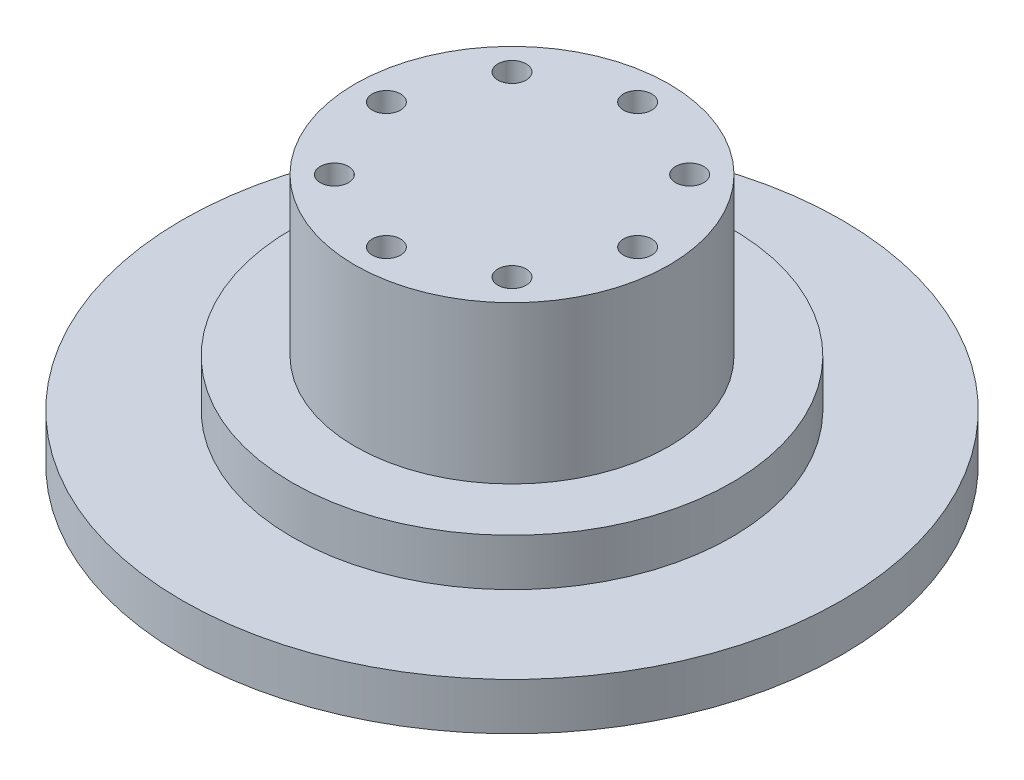
ISO-10303-21;
HEADER;
FILE_DESCRIPTION(('STEP AP214'),'2;1');
FILE_NAME('part.step','',(''),(''),'','','');
FILE_SCHEMA(('AUTOMOTIVE_DESIGN { 1 0 10303 214 1 1 1 1 }'));
ENDSEC;
DATA;
#1=APPLICATION_CONTEXT('core data for automotive mechanical design processes');
#2=APPLICATION_PROTOCOL_DEFINITION('international standard','automotive_design',2000,#1);
#3=PRODUCT_CONTEXT('',#1,'mechanical');
#4=PRODUCT('Part','Part','',(#3));
#5=PRODUCT_RELATED_PRODUCT_CATEGORY('part','',(#4));
#6=PRODUCT_DEFINITION_FORMATION('','',#4);
#7=PRODUCT_DEFINITION_CONTEXT('part definition',#1,'design');
#8=PRODUCT_DEFINITION('design','',#6,#7);
#9=PRODUCT_DEFINITION_SHAPE('','',#8);
#10=(LENGTH_UNIT() NAMED_UNIT(*) SI_UNIT(.MILLI.,.METRE.));
#11=(NAMED_UNIT(*) PLANE_ANGLE_UNIT() SI_UNIT($,.RADIAN.));
#12=(NAMED_UNIT(*) SI_UNIT($,.STERADIAN.) SOLID_ANGLE_UNIT());
#13=UNCERTAINTY_MEASURE_WITH_UNIT(LENGTH_MEASURE(1.E-05),#10,'distance_accuracy_value','');
#14=(GEOMETRIC_REPRESENTATION_CONTEXT(3) GLOBAL_UNCERTAINTY_ASSIGNED_CONTEXT((#13)) GLOBAL_UNIT_ASSIGNED_CONTEXT((#10,
#11,#12)) REPRESENTATION_CONTEXT('',''));
#15=CARTESIAN_POINT('',(0.,0.,0.));
#16=DIRECTION('',(0.,0.,1.));
#17=DIRECTION('',(1.,0.,0.));
#18=AXIS2_PLACEMENT_3D('',#15,#16,#17);
#19=CARTESIAN_POINT('',(0.,3.,0.));
#20=DIRECTION('',(0.,-1.,0.));
#21=DIRECTION('',(0.,0.,-1.));
#22=AXIS2_PLACEMENT_3D('',#19,#20,#21);
#23=CYLINDRICAL_SURFACE('',#22,21.);
#24=CARTESIAN_POINT('',(0.,3.,0.));
#25=DIRECTION('',(0.,1.,0.));
#26=DIRECTION('',(0.,0.,1.));
#27=AXIS2_PLACEMENT_3D('',#24,#25,#26);
#28=CIRCLE('',#27,21.);
#29=CARTESIAN_POINT('',(0.,3.,21.));
#30=VERTEX_POINT('',#29);
#31=EDGE_CURVE('E10',#30,#30,#28,.T.);
#32=ORIENTED_EDGE('',*,*,#31,.F.);
#33=EDGE_LOOP('',(#32));
#34=FACE_BOUND('',#33,.T.);
#35=CARTESIAN_POINT('',(0.,0.,0.));
#36=DIRECTION('',(0.,1.,0.));
#37=DIRECTION('',(0.,0.,1.));
#38=AXIS2_PLACEMENT_3D('',#35,#36,#37);
#39=CIRCLE('',#38,21.);
#40=CARTESIAN_POINT('',(0.,0.,21.));
#41=VERTEX_POINT('',#40);
#42=EDGE_CURVE('E38',#41,#41,#39,.T.);
#43=ORIENTED_EDGE('',*,*,#42,.T.);
#44=EDGE_LOOP('',(#43));
#45=FACE_BOUND('',#44,.T.);
#46=ADVANCED_FACE('F31',(#34,#45),#23,.T.);
#47=CARTESIAN_POINT('',(0.,3.,0.));
#48=DIRECTION('',(0.,1.,0.));
#49=DIRECTION('',(0.,0.,1.));
#50=AXIS2_PLACEMENT_3D('',#47,#48,#49);
#51=PLANE('',#50);
#52=CARTESIAN_POINT('',(0.,3.,0.));
#53=DIRECTION('',(0.,1.,0.));
#54=DIRECTION('',(0.,0.,1.));
#55=AXIS2_PLACEMENT_3D('',#52,#53,#54);
#56=CIRCLE('',#55,14.);
#57=CARTESIAN_POINT('',(0.,3.,14.));
#58=VERTEX_POINT('',#57);
#59=EDGE_CURVE('E47',#58,#58,#56,.T.);
#60=ORIENTED_EDGE('',*,*,#59,.F.);
#61=EDGE_LOOP('',(#60));
#62=FACE_BOUND('',#61,.T.);
#63=ORIENTED_EDGE('',*,*,#31,.T.);
#64=EDGE_LOOP('',(#63));
#65=FACE_BOUND('',#64,.T.);
#66=ADVANCED_FACE('F109',(#62,#65),#51,.T.);
#67=CARTESIAN_POINT('',(0.,0.,0.));
#68=DIRECTION('',(0.,1.,0.));
#69=DIRECTION('',(0.,0.,1.));
#70=AXIS2_PLACEMENT_3D('',#67,#68,#69);
#71=PLANE('',#70);
#72=CARTESIAN_POINT('',(-5.65685424949238,0.,5.65685424949238));
#73=DIRECTION('',(0.,-1.,0.));
#74=DIRECTION('',(0.,0.,1.));
#75=AXIS2_PLACEMENT_3D('',#72,#73,#74);
#76=CIRCLE('',#75,0.900000000000002);
#77=CARTESIAN_POINT('',(-5.65685424949238,0.,6.55685424949238));
#78=VERTEX_POINT('',#77);
#79=EDGE_CURVE('E81',#78,#78,#76,.T.);
#80=ORIENTED_EDGE('',*,*,#79,.F.);
#81=EDGE_LOOP('',(#80));
#82=FACE_BOUND('',#81,.T.);
#83=CARTESIAN_POINT('',(0.,0.,-8.));
#84=DIRECTION('',(0.,-1.,0.));
#85=DIRECTION('',(0.,0.,1.));
#86=AXIS2_PLACEMENT_3D('',#83,#84,#85);
#87=CIRCLE('',#86,0.900000000000001);
#88=CARTESIAN_POINT('',(0.,0.,-7.1));
#89=VERTEX_POINT('',#88);
#90=EDGE_CURVE('E82',#89,#89,#87,.T.);
#91=ORIENTED_EDGE('',*,*,#90,.F.);
#92=EDGE_LOOP('',(#91));
#93=FACE_BOUND('',#92,.T.);
#94=CARTESIAN_POINT('',(-5.65685424949238,0.,-5.65685424949238));
#95=DIRECTION('',(0.,-1.,0.));
#96=DIRECTION('',(0.,0.,1.));
#97=AXIS2_PLACEMENT_3D('',#94,#95,#96);
#98=CIRCLE('',#97,0.9);
#99=CARTESIAN_POINT('',(-5.65685424949238,0.,-4.75685424949238));
#100=VERTEX_POINT('',#99);
#101=EDGE_CURVE('E93',#100,#100,#98,.T.);
#102=ORIENTED_EDGE('',*,*,#101,.F.);
#103=EDGE_LOOP('',(#102));
#104=FACE_BOUND('',#103,.T.);
#105=CARTESIAN_POINT('',(-8.,0.,0.));
#106=DIRECTION('',(0.,-1.,0.));
#107=DIRECTION('',(0.,0.,-1.));
#108=AXIS2_PLACEMENT_3D('',#105,#106,#107);
#109=CIRCLE('',#108,0.899999999999998);
#110=CARTESIAN_POINT('',(-8.,0.,-0.899999999999998));
#111=VERTEX_POINT('',#110);
#112=EDGE_CURVE('E94',#111,#111,#109,.T.);
#113=ORIENTED_EDGE('',*,*,#112,.F.);
#114=EDGE_LOOP('',(#113));
#115=FACE_BOUND('',#114,.T.);
#116=CARTESIAN_POINT('',(0.,0.,8.));
#117=DIRECTION('',(0.,-1.,0.));
#118=DIRECTION('',(0.,0.,1.));
#119=AXIS2_PLACEMENT_3D('',#116,#117,#118);
#120=CIRCLE('',#119,0.9);
#121=CARTESIAN_POINT('',(0.,0.,8.9));
#122=VERTEX_POINT('',#121);
#123=EDGE_CURVE('E64',#122,#122,#120,.T.);
#124=ORIENTED_EDGE('',*,*,#123,.F.);
#125=EDGE_LOOP('',(#124));
#126=FACE_BOUND('',#125,.T.);
#127=CARTESIAN_POINT('',(5.65685424949238,0.,5.65685424949238));
#128=DIRECTION('',(0.,-1.,0.));
#129=DIRECTION('',(0.,0.,-1.));
#130=AXIS2_PLACEMENT_3D('',#127,#128,#129);
#131=CIRCLE('',#130,0.899999999999999);
#132=CARTESIAN_POINT('',(5.65685424949238,0.,4.75685424949238));
#133=VERTEX_POINT('',#132);
#134=EDGE_CURVE('E63',#133,#133,#131,.T.);
#135=ORIENTED_EDGE('',*,*,#134,.F.);
#136=EDGE_LOOP('',(#135));
#137=FACE_BOUND('',#136,.T.);
#138=CARTESIAN_POINT('',(5.65685424949238,0.,-5.65685424949238));
#139=DIRECTION('',(0.,-1.,0.));
#140=DIRECTION('',(0.,0.,-1.));
#141=AXIS2_PLACEMENT_3D('',#138,#139,#140);
#142=CIRCLE('',#141,0.899999999999999);
#143=CARTESIAN_POINT('',(5.65685424949238,0.,-6.55685424949238));
#144=VERTEX_POINT('',#143);
#145=EDGE_CURVE('E71',#144,#144,#142,.T.);
#146=ORIENTED_EDGE('',*,*,#145,.F.);
#147=EDGE_LOOP('',(#146));
#148=FACE_BOUND('',#147,.T.);
#149=CARTESIAN_POINT('',(8.,0.,0.));
#150=DIRECTION('',(0.,-1.,0.));
#151=DIRECTION('',(0.,0.,-1.));
#152=AXIS2_PLACEMENT_3D('',#149,#150,#151);
#153=CIRCLE('',#152,0.9);
#154=CARTESIAN_POINT('',(8.,0.,-0.9));
#155=VERTEX_POINT('',#154);
#156=EDGE_CURVE('E56',#155,#155,#153,.T.);
#157=ORIENTED_EDGE('',*,*,#156,.F.);
#158=EDGE_LOOP('',(#157));
#159=FACE_BOUND('',#158,.T.);
#160=ORIENTED_EDGE('',*,*,#42,.F.);
#161=EDGE_LOOP('',(#160));
#162=FACE_BOUND('',#161,.T.);
#163=ADVANCED_FACE('F105',(#82,#93,#104,#115,#126,#137,#148,#159,#162),#71,.F.);
#164=CARTESIAN_POINT('',(0.,6.,0.));
#165=DIRECTION('',(0.,-1.,0.));
#166=DIRECTION('',(0.,0.,-1.));
#167=AXIS2_PLACEMENT_3D('',#164,#165,#166);
#168=CYLINDRICAL_SURFACE('',#167,14.);
#169=CARTESIAN_POINT('',(0.,6.,0.));
#170=DIRECTION('',(0.,1.,0.));
#171=DIRECTION('',(0.,0.,1.));
#172=AXIS2_PLACEMENT_3D('',#169,#170,#171);
#173=CIRCLE('',#172,14.);
#174=CARTESIAN_POINT('',(0.,6.,14.));
#175=VERTEX_POINT('',#174);
#176=EDGE_CURVE('E50',#175,#175,#173,.T.);
#177=ORIENTED_EDGE('',*,*,#176,.F.);
#178=EDGE_LOOP('',(#177));
#179=FACE_BOUND('',#178,.T.);
#180=ORIENTED_EDGE('',*,*,#59,.T.);
#181=EDGE_LOOP('',(#180));
#182=FACE_BOUND('',#181,.T.);
#183=ADVANCED_FACE('F108',(#179,#182),#168,.T.);
#184=CARTESIAN_POINT('',(0.,6.,0.));
#185=DIRECTION('',(0.,1.,0.));
#186=DIRECTION('',(0.,0.,1.));
#187=AXIS2_PLACEMENT_3D('',#184,#185,#186);
#188=PLANE('',#187);
#189=CARTESIAN_POINT('',(0.,6.,0.));
#190=DIRECTION('',(0.,1.,0.));
#191=DIRECTION('',(0.,0.,1.));
#192=AXIS2_PLACEMENT_3D('',#189,#190,#191);
#193=CIRCLE('',#192,10.);
#194=CARTESIAN_POINT('',(0.,6.,10.));
#195=VERTEX_POINT('',#194);
#196=EDGE_CURVE('E34',#195,#195,#193,.T.);
#197=ORIENTED_EDGE('',*,*,#196,.F.);
#198=EDGE_LOOP('',(#197));
#199=FACE_BOUND('',#198,.T.);
#200=ORIENTED_EDGE('',*,*,#176,.T.);
#201=EDGE_LOOP('',(#200));
#202=FACE_BOUND('',#201,.T.);
#203=ADVANCED_FACE('F142',(#199,#202),#188,.T.);
#204=CARTESIAN_POINT('',(0.,16.,0.));
#205=DIRECTION('',(0.,1.,0.));
#206=DIRECTION('',(0.,0.,1.));
#207=AXIS2_PLACEMENT_3D('',#204,#205,#206);
#208=PLANE('',#207);
#209=CARTESIAN_POINT('',(-5.65685424949238,16.,5.65685424949238));
#210=DIRECTION('',(0.,1.,0.));
#211=DIRECTION('',(0.,0.,1.));
#212=AXIS2_PLACEMENT_3D('',#209,#210,#211);
#213=CIRCLE('',#212,0.900000000000002);
#214=CARTESIAN_POINT('',(-5.65685424949238,16.,6.55685424949238));
#215=VERTEX_POINT('',#214);
#216=EDGE_CURVE('E67',#215,#215,#213,.F.);
#217=ORIENTED_EDGE('',*,*,#216,.T.);
#218=EDGE_LOOP('',(#217));
#219=FACE_BOUND('',#218,.T.);
#220=CARTESIAN_POINT('',(0.,16.,-8.));
#221=DIRECTION('',(0.,1.,0.));
#222=DIRECTION('',(0.,0.,1.));
#223=AXIS2_PLACEMENT_3D('',#220,#221,#222);
#224=CIRCLE('',#223,0.900000000000001);
#225=CARTESIAN_POINT('',(0.,16.,-7.1));
#226=VERTEX_POINT('',#225);
#227=EDGE_CURVE('E78',#226,#226,#224,.F.);
#228=ORIENTED_EDGE('',*,*,#227,.T.);
#229=EDGE_LOOP('',(#228));
#230=FACE_BOUND('',#229,.T.);
#231=CARTESIAN_POINT('',(-5.65685424949238,16.,-5.65685424949238));
#232=DIRECTION('',(0.,1.,0.));
#233=DIRECTION('',(0.,0.,1.));
#234=AXIS2_PLACEMENT_3D('',#231,#232,#233);
#235=CIRCLE('',#234,0.9);
#236=CARTESIAN_POINT('',(-5.65685424949238,16.,-4.75685424949238));
#237=VERTEX_POINT('',#236);
#238=EDGE_CURVE('E85',#237,#237,#235,.F.);
#239=ORIENTED_EDGE('',*,*,#238,.T.);
#240=EDGE_LOOP('',(#239));
#241=FACE_BOUND('',#240,.T.);
#242=CARTESIAN_POINT('',(-8.,16.,0.));
#243=DIRECTION('',(0.,1.,0.));
#244=DIRECTION('',(0.,0.,1.));
#245=AXIS2_PLACEMENT_3D('',#242,#243,#244);
#246=CIRCLE('',#245,0.899999999999998);
#247=CARTESIAN_POINT('',(-8.,16.,0.899999999999998));
#248=VERTEX_POINT('',#247);
#249=EDGE_CURVE('E90',#248,#248,#246,.F.);
#250=ORIENTED_EDGE('',*,*,#249,.T.);
#251=EDGE_LOOP('',(#250));
#252=FACE_BOUND('',#251,.T.);
#253=CARTESIAN_POINT('',(0.,16.,8.));
#254=DIRECTION('',(0.,1.,0.));
#255=DIRECTION('',(0.,0.,1.));
#256=AXIS2_PLACEMENT_3D('',#253,#254,#255);
#257=CIRCLE('',#256,0.9);
#258=CARTESIAN_POINT('',(0.,16.,8.9));
#259=VERTEX_POINT('',#258);
#260=EDGE_CURVE('E60',#259,#259,#257,.F.);
#261=ORIENTED_EDGE('',*,*,#260,.T.);
#262=EDGE_LOOP('',(#261));
#263=FACE_BOUND('',#262,.T.);
#264=CARTESIAN_POINT('',(5.65685424949238,16.,5.65685424949238));
#265=DIRECTION('',(0.,1.,0.));
#266=DIRECTION('',(0.,0.,1.));
#267=AXIS2_PLACEMENT_3D('',#264,#265,#266);
#268=CIRCLE('',#267,0.899999999999999);
#269=CARTESIAN_POINT('',(5.65685424949238,16.,6.55685424949238));
#270=VERTEX_POINT('',#269);
#271=EDGE_CURVE('E68',#270,#270,#268,.F.);
#272=ORIENTED_EDGE('',*,*,#271,.T.);
#273=EDGE_LOOP('',(#272));
#274=FACE_BOUND('',#273,.T.);
#275=CARTESIAN_POINT('',(5.65685424949238,16.,-5.65685424949238));
#276=DIRECTION('',(0.,1.,0.));
#277=DIRECTION('',(0.,0.,1.));
#278=AXIS2_PLACEMENT_3D('',#275,#276,#277);
#279=CIRCLE('',#278,0.899999999999999);
#280=CARTESIAN_POINT('',(5.65685424949238,16.,-4.75685424949238));
#281=VERTEX_POINT('',#280);
#282=EDGE_CURVE('E59',#281,#281,#279,.F.);
#283=ORIENTED_EDGE('',*,*,#282,.T.);
#284=EDGE_LOOP('',(#283));
#285=FACE_BOUND('',#284,.T.);
#286=CARTESIAN_POINT('',(8.,16.,0.));
#287=DIRECTION('',(0.,1.,0.));
#288=DIRECTION('',(0.,0.,1.));
#289=AXIS2_PLACEMENT_3D('',#286,#287,#288);
#290=CIRCLE('',#289,0.9);
#291=CARTESIAN_POINT('',(8.,16.,0.9));
#292=VERTEX_POINT('',#291);
#293=EDGE_CURVE('E51',#292,#292,#290,.F.);
#294=ORIENTED_EDGE('',*,*,#293,.T.);
#295=EDGE_LOOP('',(#294));
#296=FACE_BOUND('',#295,.T.);
#297=CARTESIAN_POINT('',(0.,16.,0.));
#298=DIRECTION('',(0.,1.,0.));
#299=DIRECTION('',(0.,0.,1.));
#300=AXIS2_PLACEMENT_3D('',#297,#298,#299);
#301=CIRCLE('',#300,10.);
#302=CARTESIAN_POINT('',(0.,16.,10.));
#303=VERTEX_POINT('',#302);
#304=EDGE_CURVE('E43',#303,#303,#301,.T.);
#305=ORIENTED_EDGE('',*,*,#304,.T.);
#306=EDGE_LOOP('',(#305));
#307=FACE_BOUND('',#306,.T.);
#308=ADVANCED_FACE('F138',(#219,#230,#241,#252,#263,#274,#285,#296,#307),#208,.T.);
#309=CARTESIAN_POINT('',(0.,16.,0.));
#310=DIRECTION('',(0.,-1.,0.));
#311=DIRECTION('',(0.,0.,-1.));
#312=AXIS2_PLACEMENT_3D('',#309,#310,#311);
#313=CYLINDRICAL_SURFACE('',#312,10.);
#314=ORIENTED_EDGE('',*,*,#196,.T.);
#315=EDGE_LOOP('',(#314));
#316=FACE_BOUND('',#315,.T.);
#317=ORIENTED_EDGE('',*,*,#304,.F.);
#318=EDGE_LOOP('',(#317));
#319=FACE_BOUND('',#318,.T.);
#320=ADVANCED_FACE('F134',(#316,#319),#313,.T.);
#321=CARTESIAN_POINT('',(8.,18.5455844122716,0.));
#322=DIRECTION('',(0.,-1.,0.));
#323=DIRECTION('',(0.,0.,-1.));
#324=AXIS2_PLACEMENT_3D('',#321,#322,#323);
#325=CYLINDRICAL_SURFACE('',#324,0.9);
#326=ORIENTED_EDGE('',*,*,#156,.T.);
#327=EDGE_LOOP('',(#326));
#328=FACE_BOUND('',#327,.T.);
#329=ORIENTED_EDGE('',*,*,#293,.F.);
#330=EDGE_LOOP('',(#329));
#331=FACE_BOUND('',#330,.T.);
#332=ADVANCED_FACE('F137',(#328,#331),#325,.F.);
#333=CARTESIAN_POINT('',(5.65685424949238,18.5455844122716,-5.65685424949238));
#334=DIRECTION('',(0.,-1.,0.));
#335=DIRECTION('',(0.,0.,-1.));
#336=AXIS2_PLACEMENT_3D('',#333,#334,#335);
#337=CYLINDRICAL_SURFACE('',#336,0.899999999999999);
#338=ORIENTED_EDGE('',*,*,#145,.T.);
#339=EDGE_LOOP('',(#338));
#340=FACE_BOUND('',#339,.T.);
#341=ORIENTED_EDGE('',*,*,#282,.F.);
#342=EDGE_LOOP('',(#341));
#343=FACE_BOUND('',#342,.T.);
#344=ADVANCED_FACE('F152',(#340,#343),#337,.F.);
#345=CARTESIAN_POINT('',(5.65685424949238,18.5455844122716,5.65685424949238));
#346=DIRECTION('',(0.,-1.,0.));
#347=DIRECTION('',(0.,0.,-1.));
#348=AXIS2_PLACEMENT_3D('',#345,#346,#347);
#349=CYLINDRICAL_SURFACE('',#348,0.899999999999999);
#350=ORIENTED_EDGE('',*,*,#134,.T.);
#351=EDGE_LOOP('',(#350));
#352=FACE_BOUND('',#351,.T.);
#353=ORIENTED_EDGE('',*,*,#271,.F.);
#354=EDGE_LOOP('',(#353));
#355=FACE_BOUND('',#354,.T.);
#356=ADVANCED_FACE('F158',(#352,#355),#349,.F.);
#357=CARTESIAN_POINT('',(0.,18.5455844122716,8.));
#358=DIRECTION('',(0.,-1.,0.));
#359=DIRECTION('',(0.,0.,-1.));
#360=AXIS2_PLACEMENT_3D('',#357,#358,#359);
#361=CYLINDRICAL_SURFACE('',#360,0.9);
#362=ORIENTED_EDGE('',*,*,#123,.T.);
#363=EDGE_LOOP('',(#362));
#364=FACE_BOUND('',#363,.T.);
#365=ORIENTED_EDGE('',*,*,#260,.F.);
#366=EDGE_LOOP('',(#365));
#367=FACE_BOUND('',#366,.T.);
#368=ADVANCED_FACE('F154',(#364,#367),#361,.F.);
#369=CARTESIAN_POINT('',(-8.,18.5455844122716,0.));
#370=DIRECTION('',(0.,-1.,0.));
#371=DIRECTION('',(0.,0.,-1.));
#372=AXIS2_PLACEMENT_3D('',#369,#370,#371);
#373=CYLINDRICAL_SURFACE('',#372,0.899999999999998);
#374=ORIENTED_EDGE('',*,*,#112,.T.);
#375=EDGE_LOOP('',(#374));
#376=FACE_BOUND('',#375,.T.);
#377=ORIENTED_EDGE('',*,*,#249,.F.);
#378=EDGE_LOOP('',(#377));
#379=FACE_BOUND('',#378,.T.);
#380=ADVANCED_FACE('F157',(#376,#379),#373,.F.);
#381=CARTESIAN_POINT('',(-5.65685424949238,18.5455844122716,-5.65685424949238));
#382=DIRECTION('',(0.,-1.,0.));
#383=DIRECTION('',(0.,0.,-1.));
#384=AXIS2_PLACEMENT_3D('',#381,#382,#383);
#385=CYLINDRICAL_SURFACE('',#384,0.9);
#386=ORIENTED_EDGE('',*,*,#101,.T.);
#387=EDGE_LOOP('',(#386));
#388=FACE_BOUND('',#387,.T.);
#389=ORIENTED_EDGE('',*,*,#238,.F.);
#390=EDGE_LOOP('',(#389));
#391=FACE_BOUND('',#390,.T.);
#392=ADVANCED_FACE('F102',(#388,#391),#385,.F.);
#393=CARTESIAN_POINT('',(0.,18.5455844122716,-8.));
#394=DIRECTION('',(0.,-1.,0.));
#395=DIRECTION('',(0.,0.,-1.));
#396=AXIS2_PLACEMENT_3D('',#393,#394,#395);
#397=CYLINDRICAL_SURFACE('',#396,0.900000000000001);
#398=ORIENTED_EDGE('',*,*,#90,.T.);
#399=EDGE_LOOP('',(#398));
#400=FACE_BOUND('',#399,.T.);
#401=ORIENTED_EDGE('',*,*,#227,.F.);
#402=EDGE_LOOP('',(#401));
#403=FACE_BOUND('',#402,.T.);
#404=ADVANCED_FACE('F166',(#400,#403),#397,.F.);
#405=CARTESIAN_POINT('',(-5.65685424949238,18.5455844122716,5.65685424949238));
#406=DIRECTION('',(0.,-1.,0.));
#407=DIRECTION('',(0.,0.,-1.));
#408=AXIS2_PLACEMENT_3D('',#405,#406,#407);
#409=CYLINDRICAL_SURFACE('',#408,0.900000000000002);
#410=ORIENTED_EDGE('',*,*,#79,.T.);
#411=EDGE_LOOP('',(#410));
#412=FACE_BOUND('',#411,.T.);
#413=ORIENTED_EDGE('',*,*,#216,.F.);
#414=EDGE_LOOP('',(#413));
#415=FACE_BOUND('',#414,.T.);
#416=ADVANCED_FACE('F169',(#412,#415),#409,.F.);
#417=CLOSED_SHELL('',(#46,#66,#163,#183,#203,#308,#320,#332,#344,#356,#368,#380,#392,#404,#416));
#418=MANIFOLD_SOLID_BREP('B2',#417);
#419=ADVANCED_BREP_SHAPE_REPRESENTATION('',(#18,#418),#14);
#420=SHAPE_DEFINITION_REPRESENTATION(#9,#419);
ENDSEC;
END-ISO-10303-21;
